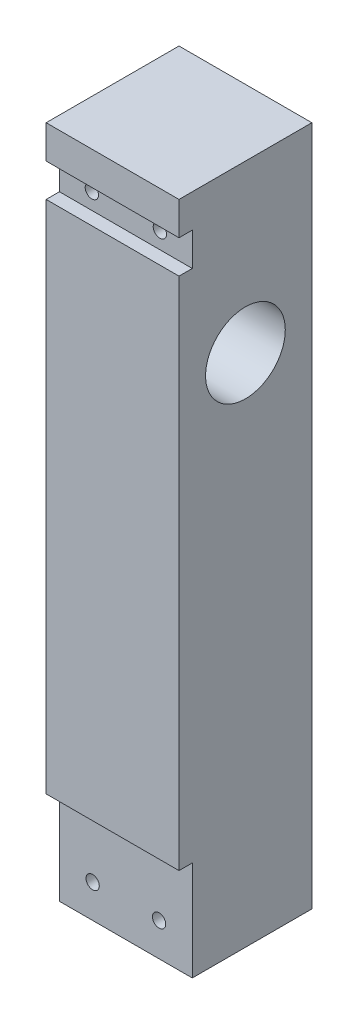
ISO-10303-21;
HEADER;
FILE_DESCRIPTION(('STEP AP214'),'2;1');
FILE_NAME('part.step','',(''),(''),'','','');
FILE_SCHEMA(('AUTOMOTIVE_DESIGN { 1 0 10303 214 1 1 1 1 }'));
ENDSEC;
DATA;
#1=APPLICATION_CONTEXT('core data for automotive mechanical design processes');
#2=APPLICATION_PROTOCOL_DEFINITION('international standard','automotive_design',2000,#1);
#3=PRODUCT_CONTEXT('',#1,'mechanical');
#4=PRODUCT('Part','Part','',(#3));
#5=PRODUCT_RELATED_PRODUCT_CATEGORY('part','',(#4));
#6=PRODUCT_DEFINITION_FORMATION('','',#4);
#7=PRODUCT_DEFINITION_CONTEXT('part definition',#1,'design');
#8=PRODUCT_DEFINITION('design','',#6,#7);
#9=PRODUCT_DEFINITION_SHAPE('','',#8);
#10=(LENGTH_UNIT() NAMED_UNIT(*) SI_UNIT(.MILLI.,.METRE.));
#11=(NAMED_UNIT(*) PLANE_ANGLE_UNIT() SI_UNIT($,.RADIAN.));
#12=(NAMED_UNIT(*) SI_UNIT($,.STERADIAN.) SOLID_ANGLE_UNIT());
#13=UNCERTAINTY_MEASURE_WITH_UNIT(LENGTH_MEASURE(1.E-05),#10,'distance_accuracy_value','');
#14=(GEOMETRIC_REPRESENTATION_CONTEXT(3) GLOBAL_UNCERTAINTY_ASSIGNED_CONTEXT((#13)) GLOBAL_UNIT_ASSIGNED_CONTEXT((#10,
#11,#12)) REPRESENTATION_CONTEXT('',''));
#15=CARTESIAN_POINT('',(0.,0.,0.));
#16=DIRECTION('',(0.,0.,1.));
#17=DIRECTION('',(1.,0.,0.));
#18=AXIS2_PLACEMENT_3D('',#15,#16,#17);
#19=CARTESIAN_POINT('',(-15.119461257796,100.,0.));
#20=DIRECTION('',(0.,0.,-1.));
#21=DIRECTION('',(0.,1.,0.));
#22=AXIS2_PLACEMENT_3D('',#19,#20,#21);
#23=CYLINDRICAL_SURFACE('',#22,1.);
#24=CARTESIAN_POINT('',(-15.119461257796,100.,-15.));
#25=DIRECTION('',(0.,0.,-1.));
#26=DIRECTION('',(0.,1.,0.));
#27=AXIS2_PLACEMENT_3D('',#24,#25,#26);
#28=CIRCLE('',#27,1.);
#29=CARTESIAN_POINT('',(-15.119461257796,101.,-15.));
#30=VERTEX_POINT('',#29);
#31=EDGE_CURVE('E42',#30,#30,#28,.T.);
#32=ORIENTED_EDGE('',*,*,#31,.T.);
#33=EDGE_LOOP('',(#32));
#34=FACE_BOUND('',#33,.T.);
#35=CARTESIAN_POINT('',(-15.119461257796,100.,-2.));
#36=DIRECTION('',(0.,0.,1.));
#37=DIRECTION('',(1.,0.,0.));
#38=AXIS2_PLACEMENT_3D('',#35,#36,#37);
#39=CIRCLE('',#38,1.);
#40=CARTESIAN_POINT('',(-14.119461257796,100.,-2.));
#41=VERTEX_POINT('',#40);
#42=EDGE_CURVE('E193',#41,#41,#39,.T.);
#43=ORIENTED_EDGE('',*,*,#42,.T.);
#44=EDGE_LOOP('',(#43));
#45=FACE_BOUND('',#44,.T.);
#46=ADVANCED_FACE('F38',(#34,#45),#23,.F.);
#47=CARTESIAN_POINT('',(-4.88053874220398,100.,0.));
#48=DIRECTION('',(0.,0.,-1.));
#49=DIRECTION('',(0.,1.,0.));
#50=AXIS2_PLACEMENT_3D('',#47,#48,#49);
#51=CYLINDRICAL_SURFACE('',#50,1.);
#52=CARTESIAN_POINT('',(-4.88053874220398,100.,-15.));
#53=DIRECTION('',(0.,0.,-1.));
#54=DIRECTION('',(0.,1.,0.));
#55=AXIS2_PLACEMENT_3D('',#52,#53,#54);
#56=CIRCLE('',#55,1.);
#57=CARTESIAN_POINT('',(-4.88053874220398,101.,-15.));
#58=VERTEX_POINT('',#57);
#59=EDGE_CURVE('E200',#58,#58,#56,.F.);
#60=ORIENTED_EDGE('',*,*,#59,.F.);
#61=EDGE_LOOP('',(#60));
#62=FACE_BOUND('',#61,.T.);
#63=CARTESIAN_POINT('',(-4.88053874220398,100.,-2.));
#64=DIRECTION('',(0.,0.,1.));
#65=DIRECTION('',(1.,0.,0.));
#66=AXIS2_PLACEMENT_3D('',#63,#64,#65);
#67=CIRCLE('',#66,1.);
#68=CARTESIAN_POINT('',(-3.88053874220398,100.,-2.));
#69=VERTEX_POINT('',#68);
#70=EDGE_CURVE('E190',#69,#69,#67,.F.);
#71=ORIENTED_EDGE('',*,*,#70,.F.);
#72=EDGE_LOOP('',(#71));
#73=FACE_BOUND('',#72,.T.);
#74=ADVANCED_FACE('F285',(#62,#73),#51,.F.);
#75=CARTESIAN_POINT('',(-20.,120.,0.));
#76=DIRECTION('',(0.,0.,1.));
#77=DIRECTION('',(0.,-1.,0.));
#78=AXIS2_PLACEMENT_3D('',#75,#76,#77);
#79=PLANE('',#78);
#80=DIRECTION('',(1.,0.,0.));
#81=VECTOR('',#80,1.);
#82=CARTESIAN_POINT('',(-20.,97.5,0.));
#83=LINE('',#82,#81);
#84=CARTESIAN_POINT('',(-20.,97.5,0.));
#85=VERTEX_POINT('',#84);
#86=CARTESIAN_POINT('',(0.,97.5,0.));
#87=VERTEX_POINT('',#86);
#88=EDGE_CURVE('E151',#85,#87,#83,.T.);
#89=ORIENTED_EDGE('',*,*,#88,.F.);
#90=DIRECTION('',(0.,-1.,0.));
#91=VECTOR('',#90,1.);
#92=CARTESIAN_POINT('',(-20.,120.,0.));
#93=LINE('',#92,#91);
#94=CARTESIAN_POINT('',(-20.,20.,0.));
#95=VERTEX_POINT('',#94);
#96=EDGE_CURVE('E230',#85,#95,#93,.T.);
#97=ORIENTED_EDGE('',*,*,#96,.T.);
#98=DIRECTION('',(-1.,0.,0.));
#99=VECTOR('',#98,1.);
#100=CARTESIAN_POINT('',(-20.,20.,0.));
#101=LINE('',#100,#99);
#102=CARTESIAN_POINT('',(0.,20.,0.));
#103=VERTEX_POINT('',#102);
#104=EDGE_CURVE('E137',#103,#95,#101,.T.);
#105=ORIENTED_EDGE('',*,*,#104,.F.);
#106=DIRECTION('',(0.,-1.,0.));
#107=VECTOR('',#106,1.);
#108=CARTESIAN_POINT('',(0.,120.,0.));
#109=LINE('',#108,#107);
#110=EDGE_CURVE('E225',#87,#103,#109,.T.);
#111=ORIENTED_EDGE('',*,*,#110,.F.);
#112=EDGE_LOOP('',(#89,#97,#105,#111));
#113=FACE_BOUND('',#112,.T.);
#114=ADVANCED_FACE('F290',(#113),#79,.T.);
#115=CARTESIAN_POINT('',(-5.,9.99999999999999,-20.));
#116=DIRECTION('',(0.,0.,1.));
#117=DIRECTION('',(1.,0.,0.));
#118=AXIS2_PLACEMENT_3D('',#115,#116,#117);
#119=CYLINDRICAL_SURFACE('',#118,1.);
#120=CARTESIAN_POINT('',(-5.,9.99999999999999,-15.));
#121=DIRECTION('',(0.,0.,-1.));
#122=DIRECTION('',(0.,1.,0.));
#123=AXIS2_PLACEMENT_3D('',#120,#121,#122);
#124=CIRCLE('',#123,1.);
#125=CARTESIAN_POINT('',(-5.,11.,-15.));
#126=VERTEX_POINT('',#125);
#127=EDGE_CURVE('E229',#126,#126,#124,.T.);
#128=ORIENTED_EDGE('',*,*,#127,.T.);
#129=EDGE_LOOP('',(#128));
#130=FACE_BOUND('',#129,.T.);
#131=CARTESIAN_POINT('',(-5.,9.99999999999999,-2.));
#132=DIRECTION('',(0.,0.,1.));
#133=DIRECTION('',(1.,0.,0.));
#134=AXIS2_PLACEMENT_3D('',#131,#132,#133);
#135=CIRCLE('',#134,1.);
#136=CARTESIAN_POINT('',(-4.,9.99999999999999,-2.));
#137=VERTEX_POINT('',#136);
#138=EDGE_CURVE('E187',#137,#137,#135,.T.);
#139=ORIENTED_EDGE('',*,*,#138,.T.);
#140=EDGE_LOOP('',(#139));
#141=FACE_BOUND('',#140,.T.);
#142=ADVANCED_FACE('F307',(#130,#141),#119,.F.);
#143=CARTESIAN_POINT('',(-15.,9.99999999999999,-20.));
#144=DIRECTION('',(0.,0.,1.));
#145=DIRECTION('',(1.,0.,0.));
#146=AXIS2_PLACEMENT_3D('',#143,#144,#145);
#147=CYLINDRICAL_SURFACE('',#146,1.);
#148=CARTESIAN_POINT('',(-15.,9.99999999999999,-15.));
#149=DIRECTION('',(0.,0.,-1.));
#150=DIRECTION('',(0.,1.,0.));
#151=AXIS2_PLACEMENT_3D('',#148,#149,#150);
#152=CIRCLE('',#151,1.);
#153=CARTESIAN_POINT('',(-15.,11.,-15.));
#154=VERTEX_POINT('',#153);
#155=EDGE_CURVE('E212',#154,#154,#152,.F.);
#156=ORIENTED_EDGE('',*,*,#155,.F.);
#157=EDGE_LOOP('',(#156));
#158=FACE_BOUND('',#157,.T.);
#159=CARTESIAN_POINT('',(-15.,9.99999999999999,-2.));
#160=DIRECTION('',(0.,0.,1.));
#161=DIRECTION('',(1.,0.,0.));
#162=AXIS2_PLACEMENT_3D('',#159,#160,#161);
#163=CIRCLE('',#162,1.);
#164=CARTESIAN_POINT('',(-14.,9.99999999999999,-2.));
#165=VERTEX_POINT('',#164);
#166=EDGE_CURVE('E167',#165,#165,#163,.F.);
#167=ORIENTED_EDGE('',*,*,#166,.F.);
#168=EDGE_LOOP('',(#167));
#169=FACE_BOUND('',#168,.T.);
#170=ADVANCED_FACE('F310',(#158,#169),#147,.F.);
#171=DIRECTION('',(1.,0.,0.));
#172=VECTOR('',#171,1.);
#173=CARTESIAN_POINT('',(-20.,107.5,0.));
#174=LINE('',#173,#172);
#175=CARTESIAN_POINT('',(-20.,107.5,0.));
#176=VERTEX_POINT('',#175);
#177=CARTESIAN_POINT('',(0.,107.5,0.));
#178=VERTEX_POINT('',#177);
#179=EDGE_CURVE('E55',#176,#178,#174,.T.);
#180=ORIENTED_EDGE('',*,*,#179,.F.);
#181=CARTESIAN_POINT('',(-20.,102.5,0.));
#182=VERTEX_POINT('',#181);
#183=EDGE_CURVE('E47',#176,#182,#93,.T.);
#184=ORIENTED_EDGE('',*,*,#183,.T.);
#185=DIRECTION('',(-1.,0.,0.));
#186=VECTOR('',#185,1.);
#187=CARTESIAN_POINT('',(-20.,102.5,0.));
#188=LINE('',#187,#186);
#189=CARTESIAN_POINT('',(0.,102.5,0.));
#190=VERTEX_POINT('',#189);
#191=EDGE_CURVE('E159',#190,#182,#188,.T.);
#192=ORIENTED_EDGE('',*,*,#191,.F.);
#193=EDGE_CURVE('E232',#178,#190,#109,.T.);
#194=ORIENTED_EDGE('',*,*,#193,.F.);
#195=EDGE_LOOP('',(#180,#184,#192,#194));
#196=FACE_BOUND('',#195,.T.);
#197=ADVANCED_FACE('F40',(#196),#79,.T.);
#198=CARTESIAN_POINT('',(-20.,120.,-20.));
#199=DIRECTION('',(0.,0.,-1.));
#200=DIRECTION('',(0.,1.,0.));
#201=AXIS2_PLACEMENT_3D('',#198,#199,#200);
#202=PLANE('',#201);
#203=DIRECTION('',(1.,0.,0.));
#204=VECTOR('',#203,1.);
#205=CARTESIAN_POINT('',(-20.,107.5,-20.));
#206=LINE('',#205,#204);
#207=CARTESIAN_POINT('',(-20.,107.5,-20.));
#208=VERTEX_POINT('',#207);
#209=CARTESIAN_POINT('',(0.,107.5,-20.));
#210=VERTEX_POINT('',#209);
#211=EDGE_CURVE('E115',#208,#210,#206,.T.);
#212=ORIENTED_EDGE('',*,*,#211,.T.);
#213=DIRECTION('',(0.,1.,0.));
#214=VECTOR('',#213,1.);
#215=CARTESIAN_POINT('',(0.,120.,-20.));
#216=LINE('',#215,#214);
#217=CARTESIAN_POINT('',(0.,5.,-20.));
#218=VERTEX_POINT('',#217);
#219=EDGE_CURVE('E136',#218,#210,#216,.T.);
#220=ORIENTED_EDGE('',*,*,#219,.F.);
#221=DIRECTION('',(-1.,0.,0.));
#222=VECTOR('',#221,1.);
#223=CARTESIAN_POINT('',(0.,5.,-20.));
#224=LINE('',#223,#222);
#225=CARTESIAN_POINT('',(-20.,5.,-20.));
#226=VERTEX_POINT('',#225);
#227=EDGE_CURVE('E135',#218,#226,#224,.T.);
#228=ORIENTED_EDGE('',*,*,#227,.T.);
#229=DIRECTION('',(0.,1.,0.));
#230=VECTOR('',#229,1.);
#231=CARTESIAN_POINT('',(-20.,120.,-20.));
#232=LINE('',#231,#230);
#233=EDGE_CURVE('E12',#226,#208,#232,.T.);
#234=ORIENTED_EDGE('',*,*,#233,.T.);
#235=EDGE_LOOP('',(#212,#220,#228,#234));
#236=FACE_BOUND('',#235,.T.);
#237=CARTESIAN_POINT('',(-4.88053874220398,100.,-20.));
#238=DIRECTION('',(0.,0.,-1.));
#239=DIRECTION('',(0.,1.,0.));
#240=AXIS2_PLACEMENT_3D('',#237,#238,#239);
#241=CIRCLE('',#240,2.);
#242=CARTESIAN_POINT('',(-4.88053874220398,102.,-20.));
#243=VERTEX_POINT('',#242);
#244=EDGE_CURVE('E201',#243,#243,#241,.T.);
#245=ORIENTED_EDGE('',*,*,#244,.F.);
#246=EDGE_LOOP('',(#245));
#247=FACE_BOUND('',#246,.T.);
#248=CARTESIAN_POINT('',(-15.119461257796,100.,-20.));
#249=DIRECTION('',(0.,0.,-1.));
#250=DIRECTION('',(0.,1.,0.));
#251=AXIS2_PLACEMENT_3D('',#248,#249,#250);
#252=CIRCLE('',#251,2.);
#253=CARTESIAN_POINT('',(-15.119461257796,102.,-20.));
#254=VERTEX_POINT('',#253);
#255=EDGE_CURVE('E196',#254,#254,#252,.T.);
#256=ORIENTED_EDGE('',*,*,#255,.F.);
#257=EDGE_LOOP('',(#256));
#258=FACE_BOUND('',#257,.T.);
#259=CARTESIAN_POINT('',(-5.,9.99999999999999,-20.));
#260=DIRECTION('',(0.,0.,-1.));
#261=DIRECTION('',(0.,1.,0.));
#262=AXIS2_PLACEMENT_3D('',#259,#260,#261);
#263=CIRCLE('',#262,2.);
#264=CARTESIAN_POINT('',(-5.,12.,-20.));
#265=VERTEX_POINT('',#264);
#266=EDGE_CURVE('E213',#265,#265,#263,.T.);
#267=ORIENTED_EDGE('',*,*,#266,.F.);
#268=EDGE_LOOP('',(#267));
#269=FACE_BOUND('',#268,.T.);
#270=CARTESIAN_POINT('',(-15.,9.99999999999999,-20.));
#271=DIRECTION('',(0.,0.,-1.));
#272=DIRECTION('',(0.,1.,0.));
#273=AXIS2_PLACEMENT_3D('',#270,#271,#272);
#274=CIRCLE('',#273,2.);
#275=CARTESIAN_POINT('',(-15.,12.,-20.));
#276=VERTEX_POINT('',#275);
#277=EDGE_CURVE('E219',#276,#276,#274,.T.);
#278=ORIENTED_EDGE('',*,*,#277,.F.);
#279=EDGE_LOOP('',(#278));
#280=FACE_BOUND('',#279,.T.);
#281=ADVANCED_FACE('F133',(#236,#247,#258,#269,#280),#202,.T.);
#282=CARTESIAN_POINT('',(-20.,0.,0.));
#283=DIRECTION('',(1.,0.,0.));
#284=DIRECTION('',(0.,0.,-1.));
#285=AXIS2_PLACEMENT_3D('',#282,#283,#284);
#286=PLANE('',#285);
#287=ORIENTED_EDGE('',*,*,#183,.F.);
#288=DIRECTION('',(0.,0.,1.));
#289=VECTOR('',#288,1.);
#290=CARTESIAN_POINT('',(-20.,107.5,-20.));
#291=LINE('',#290,#289);
#292=EDGE_CURVE('E118',#208,#176,#291,.T.);
#293=ORIENTED_EDGE('',*,*,#292,.F.);
#294=ORIENTED_EDGE('',*,*,#233,.F.);
#295=DIRECTION('',(0.,0.,-1.));
#296=VECTOR('',#295,1.);
#297=CARTESIAN_POINT('',(-20.,5.,-2.));
#298=LINE('',#297,#296);
#299=CARTESIAN_POINT('',(-20.,5.,-2.));
#300=VERTEX_POINT('',#299);
#301=EDGE_CURVE('E144',#300,#226,#298,.T.);
#302=ORIENTED_EDGE('',*,*,#301,.F.);
#303=DIRECTION('',(0.,-1.,0.));
#304=VECTOR('',#303,1.);
#305=CARTESIAN_POINT('',(-20.,20.,-2.));
#306=LINE('',#305,#304);
#307=CARTESIAN_POINT('',(-20.,20.,-2.));
#308=VERTEX_POINT('',#307);
#309=EDGE_CURVE('E178',#308,#300,#306,.T.);
#310=ORIENTED_EDGE('',*,*,#309,.F.);
#311=DIRECTION('',(0.,0.,1.));
#312=VECTOR('',#311,1.);
#313=CARTESIAN_POINT('',(-20.,20.,-2.));
#314=LINE('',#313,#312);
#315=EDGE_CURVE('E162',#308,#95,#314,.T.);
#316=ORIENTED_EDGE('',*,*,#315,.T.);
#317=ORIENTED_EDGE('',*,*,#96,.F.);
#318=DIRECTION('',(0.,0.,1.));
#319=VECTOR('',#318,1.);
#320=CARTESIAN_POINT('',(-20.,97.5,-2.));
#321=LINE('',#320,#319);
#322=CARTESIAN_POINT('',(-20.,97.5,-2.));
#323=VERTEX_POINT('',#322);
#324=EDGE_CURVE('E168',#323,#85,#321,.T.);
#325=ORIENTED_EDGE('',*,*,#324,.F.);
#326=DIRECTION('',(0.,-1.,0.));
#327=VECTOR('',#326,1.);
#328=CARTESIAN_POINT('',(-20.,102.5,-2.));
#329=LINE('',#328,#327);
#330=CARTESIAN_POINT('',(-20.,102.5,-2.));
#331=VERTEX_POINT('',#330);
#332=EDGE_CURVE('E154',#331,#323,#329,.T.);
#333=ORIENTED_EDGE('',*,*,#332,.F.);
#334=DIRECTION('',(0.,0.,1.));
#335=VECTOR('',#334,1.);
#336=CARTESIAN_POINT('',(-20.,102.5,-2.));
#337=LINE('',#336,#335);
#338=EDGE_CURVE('E170',#331,#182,#337,.T.);
#339=ORIENTED_EDGE('',*,*,#338,.T.);
#340=EDGE_LOOP('',(#287,#293,#294,#302,#310,#316,#317,#325,#333,#339));
#341=FACE_BOUND('',#340,.T.);
#342=CARTESIAN_POINT('',(-20.,82.5,-10.));
#343=DIRECTION('',(1.,0.,0.));
#344=DIRECTION('',(0.,0.,-1.));
#345=AXIS2_PLACEMENT_3D('',#342,#343,#344);
#346=CIRCLE('',#345,6.00000000000001);
#347=CARTESIAN_POINT('',(-20.,82.5,-16.));
#348=VERTEX_POINT('',#347);
#349=EDGE_CURVE('E222',#348,#348,#346,.T.);
#350=ORIENTED_EDGE('',*,*,#349,.T.);
#351=EDGE_LOOP('',(#350));
#352=FACE_BOUND('',#351,.T.);
#353=ADVANCED_FACE('F127',(#341,#352),#286,.F.);
#354=CARTESIAN_POINT('',(0.,0.,0.));
#355=DIRECTION('',(1.,0.,0.));
#356=DIRECTION('',(0.,0.,-1.));
#357=AXIS2_PLACEMENT_3D('',#354,#355,#356);
#358=PLANE('',#357);
#359=DIRECTION('',(0.,0.,1.));
#360=VECTOR('',#359,1.);
#361=CARTESIAN_POINT('',(0.,107.5,-20.));
#362=LINE('',#361,#360);
#363=EDGE_CURVE('E119',#210,#178,#362,.T.);
#364=ORIENTED_EDGE('',*,*,#363,.T.);
#365=ORIENTED_EDGE('',*,*,#193,.T.);
#366=DIRECTION('',(0.,0.,1.));
#367=VECTOR('',#366,1.);
#368=CARTESIAN_POINT('',(0.,102.5,-2.));
#369=LINE('',#368,#367);
#370=CARTESIAN_POINT('',(0.,102.5,-2.));
#371=VERTEX_POINT('',#370);
#372=EDGE_CURVE('E158',#371,#190,#369,.T.);
#373=ORIENTED_EDGE('',*,*,#372,.F.);
#374=DIRECTION('',(0.,1.,0.));
#375=VECTOR('',#374,1.);
#376=CARTESIAN_POINT('',(0.,102.5,-2.));
#377=LINE('',#376,#375);
#378=CARTESIAN_POINT('',(0.,97.5,-2.));
#379=VERTEX_POINT('',#378);
#380=EDGE_CURVE('E147',#379,#371,#377,.T.);
#381=ORIENTED_EDGE('',*,*,#380,.F.);
#382=DIRECTION('',(0.,0.,1.));
#383=VECTOR('',#382,1.);
#384=CARTESIAN_POINT('',(0.,97.5,-2.));
#385=LINE('',#384,#383);
#386=EDGE_CURVE('E164',#379,#87,#385,.T.);
#387=ORIENTED_EDGE('',*,*,#386,.T.);
#388=ORIENTED_EDGE('',*,*,#110,.T.);
#389=DIRECTION('',(0.,0.,1.));
#390=VECTOR('',#389,1.);
#391=CARTESIAN_POINT('',(0.,20.,-2.));
#392=LINE('',#391,#390);
#393=CARTESIAN_POINT('',(0.,20.,-2.));
#394=VERTEX_POINT('',#393);
#395=EDGE_CURVE('E180',#394,#103,#392,.T.);
#396=ORIENTED_EDGE('',*,*,#395,.F.);
#397=DIRECTION('',(0.,1.,0.));
#398=VECTOR('',#397,1.);
#399=CARTESIAN_POINT('',(0.,20.,-2.));
#400=LINE('',#399,#398);
#401=CARTESIAN_POINT('',(0.,5.,-2.));
#402=VERTEX_POINT('',#401);
#403=EDGE_CURVE('E140',#402,#394,#400,.T.);
#404=ORIENTED_EDGE('',*,*,#403,.F.);
#405=DIRECTION('',(0.,0.,-1.));
#406=VECTOR('',#405,1.);
#407=CARTESIAN_POINT('',(0.,5.,-2.));
#408=LINE('',#407,#406);
#409=EDGE_CURVE('E63',#402,#218,#408,.T.);
#410=ORIENTED_EDGE('',*,*,#409,.T.);
#411=ORIENTED_EDGE('',*,*,#219,.T.);
#412=EDGE_LOOP('',(#364,#365,#373,#381,#387,#388,#396,#404,#410,#411));
#413=FACE_BOUND('',#412,.T.);
#414=CARTESIAN_POINT('',(0.,82.5,-10.));
#415=DIRECTION('',(1.,0.,0.));
#416=DIRECTION('',(0.,0.,-1.));
#417=AXIS2_PLACEMENT_3D('',#414,#415,#416);
#418=CIRCLE('',#417,6.00000000000001);
#419=CARTESIAN_POINT('',(0.,82.5,-16.));
#420=VERTEX_POINT('',#419);
#421=EDGE_CURVE('E226',#420,#420,#418,.T.);
#422=ORIENTED_EDGE('',*,*,#421,.F.);
#423=EDGE_LOOP('',(#422));
#424=FACE_BOUND('',#423,.T.);
#425=ADVANCED_FACE('F331',(#413,#424),#358,.T.);
#426=CARTESIAN_POINT('',(-20.,82.5,-10.));
#427=DIRECTION('',(1.,0.,0.));
#428=DIRECTION('',(0.,0.,-1.));
#429=AXIS2_PLACEMENT_3D('',#426,#427,#428);
#430=CYLINDRICAL_SURFACE('',#429,6.00000000000001);
#431=ORIENTED_EDGE('',*,*,#349,.F.);
#432=EDGE_LOOP('',(#431));
#433=FACE_BOUND('',#432,.T.);
#434=ORIENTED_EDGE('',*,*,#421,.T.);
#435=EDGE_LOOP('',(#434));
#436=FACE_BOUND('',#435,.T.);
#437=ADVANCED_FACE('F279',(#433,#436),#430,.F.);
#438=CARTESIAN_POINT('',(-15.,9.99999999999999,-15.));
#439=DIRECTION('',(0.,0.,-1.));
#440=DIRECTION('',(0.,1.,0.));
#441=AXIS2_PLACEMENT_3D('',#438,#439,#440);
#442=PLANE('',#441);
#443=CARTESIAN_POINT('',(-15.,9.99999999999999,-15.));
#444=DIRECTION('',(0.,0.,-1.));
#445=DIRECTION('',(0.,1.,0.));
#446=AXIS2_PLACEMENT_3D('',#443,#444,#445);
#447=CIRCLE('',#446,2.);
#448=CARTESIAN_POINT('',(-15.,12.,-15.));
#449=VERTEX_POINT('',#448);
#450=EDGE_CURVE('E216',#449,#449,#447,.T.);
#451=ORIENTED_EDGE('',*,*,#450,.T.);
#452=EDGE_LOOP('',(#451));
#453=FACE_BOUND('',#452,.T.);
#454=ORIENTED_EDGE('',*,*,#155,.T.);
#455=EDGE_LOOP('',(#454));
#456=FACE_BOUND('',#455,.T.);
#457=ADVANCED_FACE('F269',(#453,#456),#442,.T.);
#458=CARTESIAN_POINT('',(-15.,9.99999999999999,-15.));
#459=DIRECTION('',(0.,0.,-1.));
#460=DIRECTION('',(0.,1.,0.));
#461=AXIS2_PLACEMENT_3D('',#458,#459,#460);
#462=CYLINDRICAL_SURFACE('',#461,2.);
#463=ORIENTED_EDGE('',*,*,#450,.F.);
#464=EDGE_LOOP('',(#463));
#465=FACE_BOUND('',#464,.T.);
#466=ORIENTED_EDGE('',*,*,#277,.T.);
#467=EDGE_LOOP('',(#466));
#468=FACE_BOUND('',#467,.T.);
#469=ADVANCED_FACE('F266',(#465,#468),#462,.F.);
#470=CARTESIAN_POINT('',(-5.,9.99999999999999,-15.));
#471=DIRECTION('',(0.,0.,-1.));
#472=DIRECTION('',(0.,1.,0.));
#473=AXIS2_PLACEMENT_3D('',#470,#471,#472);
#474=CYLINDRICAL_SURFACE('',#473,2.);
#475=CARTESIAN_POINT('',(-5.,9.99999999999999,-15.));
#476=DIRECTION('',(0.,0.,-1.));
#477=DIRECTION('',(0.,1.,0.));
#478=AXIS2_PLACEMENT_3D('',#475,#476,#477);
#479=CIRCLE('',#478,2.);
#480=CARTESIAN_POINT('',(-5.,12.,-15.));
#481=VERTEX_POINT('',#480);
#482=EDGE_CURVE('E209',#481,#481,#479,.T.);
#483=ORIENTED_EDGE('',*,*,#482,.F.);
#484=EDGE_LOOP('',(#483));
#485=FACE_BOUND('',#484,.T.);
#486=ORIENTED_EDGE('',*,*,#266,.T.);
#487=EDGE_LOOP('',(#486));
#488=FACE_BOUND('',#487,.T.);
#489=ADVANCED_FACE('F268',(#485,#488),#474,.F.);
#490=CARTESIAN_POINT('',(-5.,9.99999999999999,-15.));
#491=DIRECTION('',(0.,0.,-1.));
#492=DIRECTION('',(0.,1.,0.));
#493=AXIS2_PLACEMENT_3D('',#490,#491,#492);
#494=PLANE('',#493);
#495=ORIENTED_EDGE('',*,*,#127,.F.);
#496=EDGE_LOOP('',(#495));
#497=FACE_BOUND('',#496,.T.);
#498=ORIENTED_EDGE('',*,*,#482,.T.);
#499=EDGE_LOOP('',(#498));
#500=FACE_BOUND('',#499,.T.);
#501=ADVANCED_FACE('F276',(#497,#500),#494,.T.);
#502=CARTESIAN_POINT('',(-4.88053874220398,100.,-15.));
#503=DIRECTION('',(0.,0.,-1.));
#504=DIRECTION('',(0.,1.,0.));
#505=AXIS2_PLACEMENT_3D('',#502,#503,#504);
#506=PLANE('',#505);
#507=CARTESIAN_POINT('',(-4.88053874220398,100.,-15.));
#508=DIRECTION('',(0.,0.,-1.));
#509=DIRECTION('',(0.,1.,0.));
#510=AXIS2_PLACEMENT_3D('',#507,#508,#509);
#511=CIRCLE('',#510,2.);
#512=CARTESIAN_POINT('',(-4.88053874220398,102.,-15.));
#513=VERTEX_POINT('',#512);
#514=EDGE_CURVE('E197',#513,#513,#511,.T.);
#515=ORIENTED_EDGE('',*,*,#514,.T.);
#516=EDGE_LOOP('',(#515));
#517=FACE_BOUND('',#516,.T.);
#518=ORIENTED_EDGE('',*,*,#59,.T.);
#519=EDGE_LOOP('',(#518));
#520=FACE_BOUND('',#519,.T.);
#521=ADVANCED_FACE('F295',(#517,#520),#506,.T.);
#522=CARTESIAN_POINT('',(-4.88053874220398,100.,-15.));
#523=DIRECTION('',(0.,0.,-1.));
#524=DIRECTION('',(0.,1.,0.));
#525=AXIS2_PLACEMENT_3D('',#522,#523,#524);
#526=CYLINDRICAL_SURFACE('',#525,2.);
#527=ORIENTED_EDGE('',*,*,#514,.F.);
#528=EDGE_LOOP('',(#527));
#529=FACE_BOUND('',#528,.T.);
#530=ORIENTED_EDGE('',*,*,#244,.T.);
#531=EDGE_LOOP('',(#530));
#532=FACE_BOUND('',#531,.T.);
#533=ADVANCED_FACE('F256',(#529,#532),#526,.F.);
#534=CARTESIAN_POINT('',(-15.119461257796,100.,-15.));
#535=DIRECTION('',(0.,0.,-1.));
#536=DIRECTION('',(0.,1.,0.));
#537=AXIS2_PLACEMENT_3D('',#534,#535,#536);
#538=CYLINDRICAL_SURFACE('',#537,2.);
#539=CARTESIAN_POINT('',(-15.119461257796,100.,-15.));
#540=DIRECTION('',(0.,0.,-1.));
#541=DIRECTION('',(0.,1.,0.));
#542=AXIS2_PLACEMENT_3D('',#539,#540,#541);
#543=CIRCLE('',#542,2.);
#544=CARTESIAN_POINT('',(-15.119461257796,102.,-15.));
#545=VERTEX_POINT('',#544);
#546=EDGE_CURVE('E204',#545,#545,#543,.T.);
#547=ORIENTED_EDGE('',*,*,#546,.F.);
#548=EDGE_LOOP('',(#547));
#549=FACE_BOUND('',#548,.T.);
#550=ORIENTED_EDGE('',*,*,#255,.T.);
#551=EDGE_LOOP('',(#550));
#552=FACE_BOUND('',#551,.T.);
#553=ADVANCED_FACE('F250',(#549,#552),#538,.F.);
#554=CARTESIAN_POINT('',(-15.119461257796,100.,-15.));
#555=DIRECTION('',(0.,0.,-1.));
#556=DIRECTION('',(0.,1.,0.));
#557=AXIS2_PLACEMENT_3D('',#554,#555,#556);
#558=PLANE('',#557);
#559=ORIENTED_EDGE('',*,*,#31,.F.);
#560=EDGE_LOOP('',(#559));
#561=FACE_BOUND('',#560,.T.);
#562=ORIENTED_EDGE('',*,*,#546,.T.);
#563=EDGE_LOOP('',(#562));
#564=FACE_BOUND('',#563,.T.);
#565=ADVANCED_FACE('F246',(#561,#564),#558,.T.);
#566=CARTESIAN_POINT('',(0.,0.,-2.));
#567=DIRECTION('',(0.,0.,1.));
#568=DIRECTION('',(1.,0.,0.));
#569=AXIS2_PLACEMENT_3D('',#566,#567,#568);
#570=PLANE('',#569);
#571=DIRECTION('',(-1.,0.,0.));
#572=VECTOR('',#571,1.);
#573=CARTESIAN_POINT('',(0.,5.,-2.));
#574=LINE('',#573,#572);
#575=EDGE_CURVE('E138',#402,#300,#574,.T.);
#576=ORIENTED_EDGE('',*,*,#575,.F.);
#577=ORIENTED_EDGE('',*,*,#403,.T.);
#578=DIRECTION('',(-1.,0.,0.));
#579=VECTOR('',#578,1.);
#580=CARTESIAN_POINT('',(-20.,20.,-2.));
#581=LINE('',#580,#579);
#582=EDGE_CURVE('E175',#394,#308,#581,.T.);
#583=ORIENTED_EDGE('',*,*,#582,.T.);
#584=ORIENTED_EDGE('',*,*,#309,.T.);
#585=EDGE_LOOP('',(#576,#577,#583,#584));
#586=FACE_BOUND('',#585,.T.);
#587=ORIENTED_EDGE('',*,*,#138,.F.);
#588=EDGE_LOOP('',(#587));
#589=FACE_BOUND('',#588,.T.);
#590=ORIENTED_EDGE('',*,*,#166,.T.);
#591=EDGE_LOOP('',(#590));
#592=FACE_BOUND('',#591,.T.);
#593=ADVANCED_FACE('F249',(#586,#589,#592),#570,.T.);
#594=CARTESIAN_POINT('',(-20.,20.,-2.));
#595=DIRECTION('',(0.,1.,0.));
#596=DIRECTION('',(-1.,0.,0.));
#597=AXIS2_PLACEMENT_3D('',#594,#595,#596);
#598=PLANE('',#597);
#599=ORIENTED_EDGE('',*,*,#104,.T.);
#600=ORIENTED_EDGE('',*,*,#315,.F.);
#601=ORIENTED_EDGE('',*,*,#582,.F.);
#602=ORIENTED_EDGE('',*,*,#395,.T.);
#603=EDGE_LOOP('',(#599,#600,#601,#602));
#604=FACE_BOUND('',#603,.T.);
#605=ADVANCED_FACE('F316',(#604),#598,.F.);
#606=CARTESIAN_POINT('',(0.,0.,-2.));
#607=DIRECTION('',(0.,0.,1.));
#608=DIRECTION('',(1.,0.,0.));
#609=AXIS2_PLACEMENT_3D('',#606,#607,#608);
#610=PLANE('',#609);
#611=ORIENTED_EDGE('',*,*,#42,.F.);
#612=EDGE_LOOP('',(#611));
#613=FACE_BOUND('',#612,.T.);
#614=ORIENTED_EDGE('',*,*,#380,.T.);
#615=DIRECTION('',(-1.,0.,0.));
#616=VECTOR('',#615,1.);
#617=CARTESIAN_POINT('',(-20.,102.5,-2.));
#618=LINE('',#617,#616);
#619=EDGE_CURVE('E150',#371,#331,#618,.T.);
#620=ORIENTED_EDGE('',*,*,#619,.T.);
#621=ORIENTED_EDGE('',*,*,#332,.T.);
#622=DIRECTION('',(1.,0.,0.));
#623=VECTOR('',#622,1.);
#624=CARTESIAN_POINT('',(-20.,97.5,-2.));
#625=LINE('',#624,#623);
#626=EDGE_CURVE('E156',#323,#379,#625,.T.);
#627=ORIENTED_EDGE('',*,*,#626,.T.);
#628=EDGE_LOOP('',(#614,#620,#621,#627));
#629=FACE_BOUND('',#628,.T.);
#630=ORIENTED_EDGE('',*,*,#70,.T.);
#631=EDGE_LOOP('',(#630));
#632=FACE_BOUND('',#631,.T.);
#633=ADVANCED_FACE('F353',(#613,#629,#632),#610,.T.);
#634=CARTESIAN_POINT('',(-20.,97.5,-2.));
#635=DIRECTION('',(0.,-1.,0.));
#636=DIRECTION('',(0.,0.,-1.));
#637=AXIS2_PLACEMENT_3D('',#634,#635,#636);
#638=PLANE('',#637);
#639=ORIENTED_EDGE('',*,*,#88,.T.);
#640=ORIENTED_EDGE('',*,*,#386,.F.);
#641=ORIENTED_EDGE('',*,*,#626,.F.);
#642=ORIENTED_EDGE('',*,*,#324,.T.);
#643=EDGE_LOOP('',(#639,#640,#641,#642));
#644=FACE_BOUND('',#643,.T.);
#645=ADVANCED_FACE('F357',(#644),#638,.F.);
#646=CARTESIAN_POINT('',(-20.,102.5,-2.));
#647=DIRECTION('',(0.,1.,0.));
#648=DIRECTION('',(0.,0.,1.));
#649=AXIS2_PLACEMENT_3D('',#646,#647,#648);
#650=PLANE('',#649);
#651=ORIENTED_EDGE('',*,*,#191,.T.);
#652=ORIENTED_EDGE('',*,*,#338,.F.);
#653=ORIENTED_EDGE('',*,*,#619,.F.);
#654=ORIENTED_EDGE('',*,*,#372,.T.);
#655=EDGE_LOOP('',(#651,#652,#653,#654));
#656=FACE_BOUND('',#655,.T.);
#657=ADVANCED_FACE('F347',(#656),#650,.F.);
#658=CARTESIAN_POINT('',(0.,5.,-2.));
#659=DIRECTION('',(0.,1.,0.));
#660=DIRECTION('',(0.,0.,1.));
#661=AXIS2_PLACEMENT_3D('',#658,#659,#660);
#662=PLANE('',#661);
#663=ORIENTED_EDGE('',*,*,#301,.T.);
#664=ORIENTED_EDGE('',*,*,#227,.F.);
#665=ORIENTED_EDGE('',*,*,#409,.F.);
#666=ORIENTED_EDGE('',*,*,#575,.T.);
#667=EDGE_LOOP('',(#663,#664,#665,#666));
#668=FACE_BOUND('',#667,.T.);
#669=ADVANCED_FACE('F371',(#668),#662,.F.);
#670=CARTESIAN_POINT('',(-20.,107.5,-20.));
#671=DIRECTION('',(0.,-1.,0.));
#672=DIRECTION('',(0.,0.,-1.));
#673=AXIS2_PLACEMENT_3D('',#670,#671,#672);
#674=PLANE('',#673);
#675=ORIENTED_EDGE('',*,*,#179,.T.);
#676=ORIENTED_EDGE('',*,*,#363,.F.);
#677=ORIENTED_EDGE('',*,*,#211,.F.);
#678=ORIENTED_EDGE('',*,*,#292,.T.);
#679=EDGE_LOOP('',(#675,#676,#677,#678));
#680=FACE_BOUND('',#679,.T.);
#681=ADVANCED_FACE('F117',(#680),#674,.F.);
#682=CLOSED_SHELL('',(#46,#74,#114,#142,#170,#197,#281,#353,#425,#437,#457,#469,#489,#501,#521,
#533,#553,#565,#593,#605,#633,#645,#657,#669,#681));
#683=MANIFOLD_SOLID_BREP('B2',#682);
#684=ADVANCED_BREP_SHAPE_REPRESENTATION('',(#18,#683),#14);
#685=SHAPE_DEFINITION_REPRESENTATION(#9,#684);
ENDSEC;
END-ISO-10303-21;
